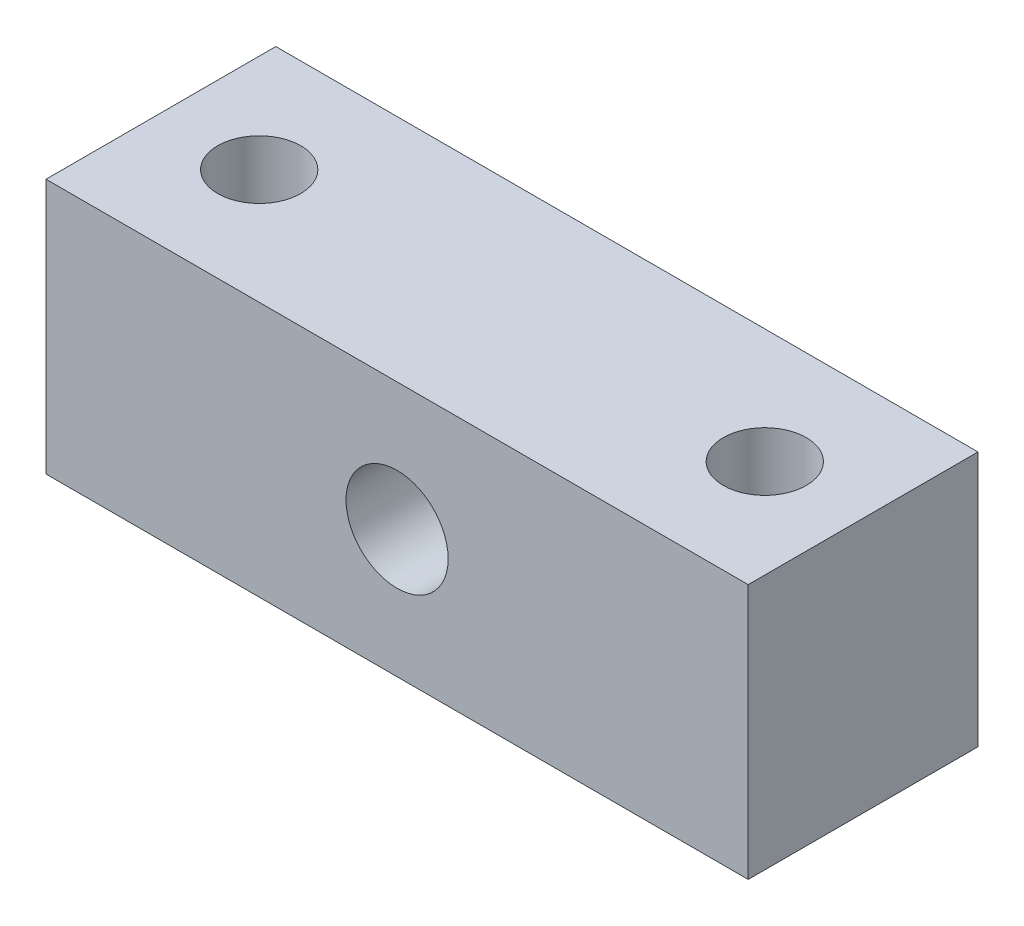
ISO-10303-21;
HEADER;
FILE_DESCRIPTION(('STEP AP214'),'2;1');
FILE_NAME('part.step','',(''),(''),'','','');
FILE_SCHEMA(('AUTOMOTIVE_DESIGN { 1 0 10303 214 1 1 1 1 }'));
ENDSEC;
DATA;
#1=APPLICATION_CONTEXT('core data for automotive mechanical design processes');
#2=APPLICATION_PROTOCOL_DEFINITION('international standard','automotive_design',2000,#1);
#3=PRODUCT_CONTEXT('',#1,'mechanical');
#4=PRODUCT('Part','Part','',(#3));
#5=PRODUCT_RELATED_PRODUCT_CATEGORY('part','',(#4));
#6=PRODUCT_DEFINITION_FORMATION('','',#4);
#7=PRODUCT_DEFINITION_CONTEXT('part definition',#1,'design');
#8=PRODUCT_DEFINITION('design','',#6,#7);
#9=PRODUCT_DEFINITION_SHAPE('','',#8);
#10=(LENGTH_UNIT() NAMED_UNIT(*) SI_UNIT(.MILLI.,.METRE.));
#11=(NAMED_UNIT(*) PLANE_ANGLE_UNIT() SI_UNIT($,.RADIAN.));
#12=(NAMED_UNIT(*) SI_UNIT($,.STERADIAN.) SOLID_ANGLE_UNIT());
#13=UNCERTAINTY_MEASURE_WITH_UNIT(LENGTH_MEASURE(1.E-05),#10,'distance_accuracy_value','');
#14=(GEOMETRIC_REPRESENTATION_CONTEXT(3) GLOBAL_UNCERTAINTY_ASSIGNED_CONTEXT((#13)) GLOBAL_UNIT_ASSIGNED_CONTEXT((#10,
#11,#12)) REPRESENTATION_CONTEXT('',''));
#15=CARTESIAN_POINT('',(0.,0.,0.));
#16=DIRECTION('',(0.,0.,1.));
#17=DIRECTION('',(1.,0.,0.));
#18=AXIS2_PLACEMENT_3D('',#15,#16,#17);
#19=CARTESIAN_POINT('',(27.5,-10.,18.));
#20=DIRECTION('',(-1.,0.,0.));
#21=DIRECTION('',(0.,0.,1.));
#22=AXIS2_PLACEMENT_3D('',#19,#20,#21);
#23=PLANE('',#22);
#24=DIRECTION('',(0.,1.,0.));
#25=VECTOR('',#24,1.);
#26=CARTESIAN_POINT('',(27.5,-10.,0.));
#27=LINE('',#26,#25);
#28=CARTESIAN_POINT('',(27.5,-10.,0.));
#29=VERTEX_POINT('',#28);
#30=CARTESIAN_POINT('',(27.5,10.,0.));
#31=VERTEX_POINT('',#30);
#32=EDGE_CURVE('E100',#29,#31,#27,.T.);
#33=ORIENTED_EDGE('',*,*,#32,.T.);
#34=DIRECTION('',(0.,0.,-1.));
#35=VECTOR('',#34,1.);
#36=CARTESIAN_POINT('',(27.5,10.,18.));
#37=LINE('',#36,#35);
#38=CARTESIAN_POINT('',(27.5,10.,18.));
#39=VERTEX_POINT('',#38);
#40=EDGE_CURVE('E11',#39,#31,#37,.T.);
#41=ORIENTED_EDGE('',*,*,#40,.F.);
#42=DIRECTION('',(0.,1.,0.));
#43=VECTOR('',#42,1.);
#44=CARTESIAN_POINT('',(27.5,-10.,18.));
#45=LINE('',#44,#43);
#46=CARTESIAN_POINT('',(27.5,-10.,18.));
#47=VERTEX_POINT('',#46);
#48=EDGE_CURVE('E88',#47,#39,#45,.T.);
#49=ORIENTED_EDGE('',*,*,#48,.F.);
#50=DIRECTION('',(0.,0.,-1.));
#51=VECTOR('',#50,1.);
#52=CARTESIAN_POINT('',(27.5,-10.,18.));
#53=LINE('',#52,#51);
#54=EDGE_CURVE('E96',#47,#29,#53,.T.);
#55=ORIENTED_EDGE('',*,*,#54,.T.);
#56=EDGE_LOOP('',(#33,#41,#49,#55));
#57=FACE_BOUND('',#56,.T.);
#58=ADVANCED_FACE('F37',(#57),#23,.F.);
#59=CARTESIAN_POINT('',(-27.5,10.,18.));
#60=DIRECTION('',(0.,-1.,0.));
#61=DIRECTION('',(0.,0.,-1.));
#62=AXIS2_PLACEMENT_3D('',#59,#60,#61);
#63=PLANE('',#62);
#64=CARTESIAN_POINT('',(19.8,10.,9.));
#65=DIRECTION('',(0.,1.,0.));
#66=DIRECTION('',(0.,0.,1.));
#67=AXIS2_PLACEMENT_3D('',#64,#65,#66);
#68=CIRCLE('',#67,3.25);
#69=CARTESIAN_POINT('',(19.8,10.,12.25));
#70=VERTEX_POINT('',#69);
#71=EDGE_CURVE('E128',#70,#70,#68,.T.);
#72=ORIENTED_EDGE('',*,*,#71,.F.);
#73=EDGE_LOOP('',(#72));
#74=FACE_BOUND('',#73,.T.);
#75=CARTESIAN_POINT('',(-19.8,10.,9.));
#76=DIRECTION('',(0.,1.,0.));
#77=DIRECTION('',(0.,0.,1.));
#78=AXIS2_PLACEMENT_3D('',#75,#76,#77);
#79=CIRCLE('',#78,3.25);
#80=CARTESIAN_POINT('',(-19.8,10.,12.25));
#81=VERTEX_POINT('',#80);
#82=EDGE_CURVE('E122',#81,#81,#79,.T.);
#83=ORIENTED_EDGE('',*,*,#82,.F.);
#84=EDGE_LOOP('',(#83));
#85=FACE_BOUND('',#84,.T.);
#86=DIRECTION('',(-1.,0.,0.));
#87=VECTOR('',#86,1.);
#88=CARTESIAN_POINT('',(-27.5,10.,0.));
#89=LINE('',#88,#87);
#90=CARTESIAN_POINT('',(-27.5,10.,0.));
#91=VERTEX_POINT('',#90);
#92=EDGE_CURVE('E92',#31,#91,#89,.T.);
#93=ORIENTED_EDGE('',*,*,#92,.T.);
#94=DIRECTION('',(0.,0.,-1.));
#95=VECTOR('',#94,1.);
#96=CARTESIAN_POINT('',(-27.5,10.,18.));
#97=LINE('',#96,#95);
#98=CARTESIAN_POINT('',(-27.5,10.,18.));
#99=VERTEX_POINT('',#98);
#100=EDGE_CURVE('E45',#99,#91,#97,.T.);
#101=ORIENTED_EDGE('',*,*,#100,.F.);
#102=DIRECTION('',(-1.,0.,0.));
#103=VECTOR('',#102,1.);
#104=CARTESIAN_POINT('',(-27.5,10.,18.));
#105=LINE('',#104,#103);
#106=EDGE_CURVE('E83',#39,#99,#105,.T.);
#107=ORIENTED_EDGE('',*,*,#106,.F.);
#108=ORIENTED_EDGE('',*,*,#40,.T.);
#109=EDGE_LOOP('',(#93,#101,#107,#108));
#110=FACE_BOUND('',#109,.T.);
#111=ADVANCED_FACE('F91',(#74,#85,#110),#63,.F.);
#112=CARTESIAN_POINT('',(-27.5,-10.,18.));
#113=DIRECTION('',(1.,0.,0.));
#114=DIRECTION('',(0.,0.,-1.));
#115=AXIS2_PLACEMENT_3D('',#112,#113,#114);
#116=PLANE('',#115);
#117=DIRECTION('',(0.,-1.,0.));
#118=VECTOR('',#117,1.);
#119=CARTESIAN_POINT('',(-27.5,-10.,0.));
#120=LINE('',#119,#118);
#121=CARTESIAN_POINT('',(-27.5,-10.,0.));
#122=VERTEX_POINT('',#121);
#123=EDGE_CURVE('E70',#91,#122,#120,.T.);
#124=ORIENTED_EDGE('',*,*,#123,.T.);
#125=DIRECTION('',(0.,0.,-1.));
#126=VECTOR('',#125,1.);
#127=CARTESIAN_POINT('',(-27.5,-10.,18.));
#128=LINE('',#127,#126);
#129=CARTESIAN_POINT('',(-27.5,-10.,18.));
#130=VERTEX_POINT('',#129);
#131=EDGE_CURVE('E93',#130,#122,#128,.T.);
#132=ORIENTED_EDGE('',*,*,#131,.F.);
#133=DIRECTION('',(0.,-1.,0.));
#134=VECTOR('',#133,1.);
#135=CARTESIAN_POINT('',(-27.5,-10.,18.));
#136=LINE('',#135,#134);
#137=EDGE_CURVE('E86',#99,#130,#136,.T.);
#138=ORIENTED_EDGE('',*,*,#137,.F.);
#139=ORIENTED_EDGE('',*,*,#100,.T.);
#140=EDGE_LOOP('',(#124,#132,#138,#139));
#141=FACE_BOUND('',#140,.T.);
#142=ADVANCED_FACE('F94',(#141),#116,.F.);
#143=CARTESIAN_POINT('',(-27.5,-10.,18.));
#144=DIRECTION('',(0.,1.,0.));
#145=DIRECTION('',(0.,0.,1.));
#146=AXIS2_PLACEMENT_3D('',#143,#144,#145);
#147=PLANE('',#146);
#148=CARTESIAN_POINT('',(19.8,-10.,9.));
#149=DIRECTION('',(0.,1.,0.));
#150=DIRECTION('',(0.,0.,1.));
#151=AXIS2_PLACEMENT_3D('',#148,#149,#150);
#152=CIRCLE('',#151,3.25);
#153=CARTESIAN_POINT('',(19.8,-10.,12.25));
#154=VERTEX_POINT('',#153);
#155=EDGE_CURVE('E125',#154,#154,#152,.T.);
#156=ORIENTED_EDGE('',*,*,#155,.T.);
#157=EDGE_LOOP('',(#156));
#158=FACE_BOUND('',#157,.T.);
#159=CARTESIAN_POINT('',(-19.8,-10.,9.));
#160=DIRECTION('',(0.,1.,0.));
#161=DIRECTION('',(0.,0.,1.));
#162=AXIS2_PLACEMENT_3D('',#159,#160,#161);
#163=CIRCLE('',#162,3.25);
#164=CARTESIAN_POINT('',(-19.8,-10.,12.25));
#165=VERTEX_POINT('',#164);
#166=EDGE_CURVE('E117',#165,#165,#163,.T.);
#167=ORIENTED_EDGE('',*,*,#166,.T.);
#168=EDGE_LOOP('',(#167));
#169=FACE_BOUND('',#168,.T.);
#170=DIRECTION('',(1.,0.,0.));
#171=VECTOR('',#170,1.);
#172=CARTESIAN_POINT('',(-27.5,-10.,0.));
#173=LINE('',#172,#171);
#174=EDGE_CURVE('E76',#122,#29,#173,.T.);
#175=ORIENTED_EDGE('',*,*,#174,.T.);
#176=ORIENTED_EDGE('',*,*,#54,.F.);
#177=DIRECTION('',(1.,0.,0.));
#178=VECTOR('',#177,1.);
#179=CARTESIAN_POINT('',(-27.5,-10.,18.));
#180=LINE('',#179,#178);
#181=EDGE_CURVE('E53',#130,#47,#180,.T.);
#182=ORIENTED_EDGE('',*,*,#181,.F.);
#183=ORIENTED_EDGE('',*,*,#131,.T.);
#184=EDGE_LOOP('',(#175,#176,#182,#183));
#185=FACE_BOUND('',#184,.T.);
#186=ADVANCED_FACE('F108',(#158,#169,#185),#147,.F.);
#187=CARTESIAN_POINT('',(0.,0.,18.));
#188=DIRECTION('',(0.,0.,-1.));
#189=DIRECTION('',(-1.,0.,0.));
#190=AXIS2_PLACEMENT_3D('',#187,#188,#189);
#191=PLANE('',#190);
#192=CARTESIAN_POINT('',(0.,0.,18.));
#193=DIRECTION('',(0.,0.,1.));
#194=DIRECTION('',(1.,0.,0.));
#195=AXIS2_PLACEMENT_3D('',#192,#193,#194);
#196=CIRCLE('',#195,4.);
#197=CARTESIAN_POINT('',(4.,0.,18.));
#198=VERTEX_POINT('',#197);
#199=EDGE_CURVE('E114',#198,#198,#196,.T.);
#200=ORIENTED_EDGE('',*,*,#199,.F.);
#201=EDGE_LOOP('',(#200));
#202=FACE_BOUND('',#201,.T.);
#203=ORIENTED_EDGE('',*,*,#48,.T.);
#204=ORIENTED_EDGE('',*,*,#106,.T.);
#205=ORIENTED_EDGE('',*,*,#137,.T.);
#206=ORIENTED_EDGE('',*,*,#181,.T.);
#207=EDGE_LOOP('',(#203,#204,#205,#206));
#208=FACE_BOUND('',#207,.T.);
#209=ADVANCED_FACE('F84',(#202,#208),#191,.F.);
#210=CARTESIAN_POINT('',(0.,0.,0.));
#211=DIRECTION('',(0.,0.,-1.));
#212=DIRECTION('',(-1.,0.,0.));
#213=AXIS2_PLACEMENT_3D('',#210,#211,#212);
#214=PLANE('',#213);
#215=CARTESIAN_POINT('',(0.,0.,0.));
#216=DIRECTION('',(0.,0.,1.));
#217=DIRECTION('',(1.,0.,0.));
#218=AXIS2_PLACEMENT_3D('',#215,#216,#217);
#219=CIRCLE('',#218,4.);
#220=CARTESIAN_POINT('',(4.,0.,0.));
#221=VERTEX_POINT('',#220);
#222=EDGE_CURVE('E103',#221,#221,#219,.T.);
#223=ORIENTED_EDGE('',*,*,#222,.T.);
#224=EDGE_LOOP('',(#223));
#225=FACE_BOUND('',#224,.T.);
#226=ORIENTED_EDGE('',*,*,#32,.F.);
#227=ORIENTED_EDGE('',*,*,#174,.F.);
#228=ORIENTED_EDGE('',*,*,#123,.F.);
#229=ORIENTED_EDGE('',*,*,#92,.F.);
#230=EDGE_LOOP('',(#226,#227,#228,#229));
#231=FACE_BOUND('',#230,.T.);
#232=ADVANCED_FACE('F111',(#225,#231),#214,.T.);
#233=CARTESIAN_POINT('',(0.,0.,0.));
#234=DIRECTION('',(0.,0.,1.));
#235=DIRECTION('',(1.,0.,0.));
#236=AXIS2_PLACEMENT_3D('',#233,#234,#235);
#237=CYLINDRICAL_SURFACE('',#236,4.);
#238=ORIENTED_EDGE('',*,*,#222,.F.);
#239=EDGE_LOOP('',(#238));
#240=FACE_BOUND('',#239,.T.);
#241=ORIENTED_EDGE('',*,*,#199,.T.);
#242=EDGE_LOOP('',(#241));
#243=FACE_BOUND('',#242,.T.);
#244=ADVANCED_FACE('F140',(#240,#243),#237,.F.);
#245=CARTESIAN_POINT('',(-19.8,10.,9.));
#246=DIRECTION('',(0.,1.,0.));
#247=DIRECTION('',(0.,0.,1.));
#248=AXIS2_PLACEMENT_3D('',#245,#246,#247);
#249=CYLINDRICAL_SURFACE('',#248,3.25);
#250=ORIENTED_EDGE('',*,*,#166,.F.);
#251=EDGE_LOOP('',(#250));
#252=FACE_BOUND('',#251,.T.);
#253=ORIENTED_EDGE('',*,*,#82,.T.);
#254=EDGE_LOOP('',(#253));
#255=FACE_BOUND('',#254,.T.);
#256=ADVANCED_FACE('F138',(#252,#255),#249,.F.);
#257=CARTESIAN_POINT('',(19.8,10.,9.));
#258=DIRECTION('',(0.,1.,0.));
#259=DIRECTION('',(0.,0.,1.));
#260=AXIS2_PLACEMENT_3D('',#257,#258,#259);
#261=CYLINDRICAL_SURFACE('',#260,3.25);
#262=ORIENTED_EDGE('',*,*,#155,.F.);
#263=EDGE_LOOP('',(#262));
#264=FACE_BOUND('',#263,.T.);
#265=ORIENTED_EDGE('',*,*,#71,.T.);
#266=EDGE_LOOP('',(#265));
#267=FACE_BOUND('',#266,.T.);
#268=ADVANCED_FACE('F132',(#264,#267),#261,.F.);
#269=CLOSED_SHELL('',(#58,#111,#142,#186,#209,#232,#244,#256,#268));
#270=MANIFOLD_SOLID_BREP('B2',#269);
#271=ADVANCED_BREP_SHAPE_REPRESENTATION('',(#18,#270),#14);
#272=SHAPE_DEFINITION_REPRESENTATION(#9,#271);
ENDSEC;
END-ISO-10303-21;
